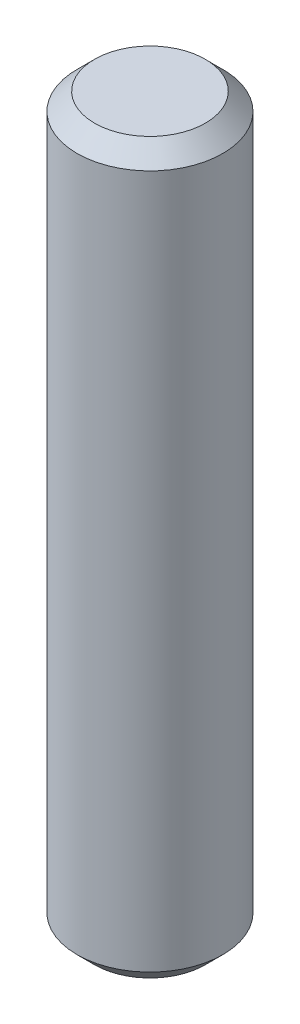
ISO-10303-21;
HEADER;
FILE_DESCRIPTION(('STEP AP214'),'2;1');
FILE_NAME('part.step','',(''),(''),'','','');
FILE_SCHEMA(('AUTOMOTIVE_DESIGN { 1 0 10303 214 1 1 1 1 }'));
ENDSEC;
DATA;
#1=APPLICATION_CONTEXT('core data for automotive mechanical design processes');
#2=APPLICATION_PROTOCOL_DEFINITION('international standard','automotive_design',2000,#1);
#3=PRODUCT_CONTEXT('',#1,'mechanical');
#4=PRODUCT('Part','Part','',(#3));
#5=PRODUCT_RELATED_PRODUCT_CATEGORY('part','',(#4));
#6=PRODUCT_DEFINITION_FORMATION('','',#4);
#7=PRODUCT_DEFINITION_CONTEXT('part definition',#1,'design');
#8=PRODUCT_DEFINITION('design','',#6,#7);
#9=PRODUCT_DEFINITION_SHAPE('','',#8);
#10=(LENGTH_UNIT() NAMED_UNIT(*) SI_UNIT(.MILLI.,.METRE.));
#11=(NAMED_UNIT(*) PLANE_ANGLE_UNIT() SI_UNIT($,.RADIAN.));
#12=(NAMED_UNIT(*) SI_UNIT($,.STERADIAN.) SOLID_ANGLE_UNIT());
#13=UNCERTAINTY_MEASURE_WITH_UNIT(LENGTH_MEASURE(1.E-05),#10,'distance_accuracy_value','');
#14=(GEOMETRIC_REPRESENTATION_CONTEXT(3) GLOBAL_UNCERTAINTY_ASSIGNED_CONTEXT((#13)) GLOBAL_UNIT_ASSIGNED_CONTEXT((#10,
#11,#12)) REPRESENTATION_CONTEXT('',''));
#15=CARTESIAN_POINT('',(0.,0.,0.));
#16=DIRECTION('',(0.,0.,1.));
#17=DIRECTION('',(1.,0.,0.));
#18=AXIS2_PLACEMENT_3D('',#15,#16,#17);
#19=CARTESIAN_POINT('',(0.,63.5,0.));
#20=DIRECTION('',(0.,-1.,0.));
#21=DIRECTION('',(0.,0.,-1.));
#22=AXIS2_PLACEMENT_3D('',#19,#20,#21);
#23=CYLINDRICAL_SURFACE('',#22,6.35);
#24=CARTESIAN_POINT('',(0.,1.524,0.));
#25=DIRECTION('',(0.,1.,0.));
#26=DIRECTION('',(0.,0.,1.));
#27=AXIS2_PLACEMENT_3D('',#24,#25,#26);
#28=CIRCLE('',#27,6.35);
#29=CARTESIAN_POINT('',(0.,1.524,6.35));
#30=VERTEX_POINT('',#29);
#31=EDGE_CURVE('E53',#30,#30,#28,.T.);
#32=ORIENTED_EDGE('',*,*,#31,.T.);
#33=EDGE_LOOP('',(#32));
#34=FACE_BOUND('',#33,.T.);
#35=CARTESIAN_POINT('',(0.,61.976,0.));
#36=DIRECTION('',(0.,1.,0.));
#37=DIRECTION('',(0.,0.,1.));
#38=AXIS2_PLACEMENT_3D('',#35,#36,#37);
#39=CIRCLE('',#38,6.35);
#40=CARTESIAN_POINT('',(0.,61.976,6.35));
#41=VERTEX_POINT('',#40);
#42=EDGE_CURVE('E58',#41,#41,#39,.F.);
#43=ORIENTED_EDGE('',*,*,#42,.T.);
#44=EDGE_LOOP('',(#43));
#45=FACE_BOUND('',#44,.T.);
#46=ADVANCED_FACE('F39',(#34,#45),#23,.T.);
#47=CARTESIAN_POINT('',(0.,63.5,0.));
#48=DIRECTION('',(0.,1.,0.));
#49=DIRECTION('',(0.,0.,1.));
#50=AXIS2_PLACEMENT_3D('',#47,#48,#49);
#51=PLANE('',#50);
#52=CARTESIAN_POINT('',(0.,63.5,0.));
#53=DIRECTION('',(0.,1.,0.));
#54=DIRECTION('',(0.,0.,1.));
#55=AXIS2_PLACEMENT_3D('',#52,#53,#54);
#56=CIRCLE('',#55,4.826);
#57=CARTESIAN_POINT('',(0.,63.5,4.826));
#58=VERTEX_POINT('',#57);
#59=EDGE_CURVE('E10',#58,#58,#56,.T.);
#60=ORIENTED_EDGE('',*,*,#59,.T.);
#61=EDGE_LOOP('',(#60));
#62=FACE_BOUND('',#61,.T.);
#63=ADVANCED_FACE('F75',(#62),#51,.T.);
#64=CARTESIAN_POINT('',(0.,0.,0.));
#65=DIRECTION('',(0.,1.,0.));
#66=DIRECTION('',(0.,0.,1.));
#67=AXIS2_PLACEMENT_3D('',#64,#65,#66);
#68=PLANE('',#67);
#69=CARTESIAN_POINT('',(0.,0.,0.));
#70=DIRECTION('',(0.,1.,0.));
#71=DIRECTION('',(0.,0.,1.));
#72=AXIS2_PLACEMENT_3D('',#69,#70,#71);
#73=CIRCLE('',#72,4.826);
#74=CARTESIAN_POINT('',(0.,0.,4.826));
#75=VERTEX_POINT('',#74);
#76=EDGE_CURVE('E48',#75,#75,#73,.F.);
#77=ORIENTED_EDGE('',*,*,#76,.T.);
#78=EDGE_LOOP('',(#77));
#79=FACE_BOUND('',#78,.T.);
#80=ADVANCED_FACE('F72',(#79),#68,.F.);
#81=CARTESIAN_POINT('',(0.,1.524,0.));
#82=DIRECTION('',(0.,1.,0.));
#83=DIRECTION('',(0.,0.,1.));
#84=AXIS2_PLACEMENT_3D('',#81,#82,#83);
#85=CONICAL_SURFACE('',#84,6.35,0.78539816339745);
#86=ORIENTED_EDGE('',*,*,#76,.F.);
#87=EDGE_LOOP('',(#86));
#88=FACE_BOUND('',#87,.T.);
#89=ORIENTED_EDGE('',*,*,#31,.F.);
#90=EDGE_LOOP('',(#89));
#91=FACE_BOUND('',#90,.T.);
#92=ADVANCED_FACE('F68',(#88,#91),#85,.T.);
#93=CARTESIAN_POINT('',(0.,63.5,0.));
#94=DIRECTION('',(0.,-1.,0.));
#95=DIRECTION('',(0.,0.,-1.));
#96=AXIS2_PLACEMENT_3D('',#93,#94,#95);
#97=CONICAL_SURFACE('',#96,4.826,0.78539816339745);
#98=ORIENTED_EDGE('',*,*,#42,.F.);
#99=EDGE_LOOP('',(#98));
#100=FACE_BOUND('',#99,.T.);
#101=ORIENTED_EDGE('',*,*,#59,.F.);
#102=EDGE_LOOP('',(#101));
#103=FACE_BOUND('',#102,.T.);
#104=ADVANCED_FACE('F42',(#100,#103),#97,.T.);
#105=CLOSED_SHELL('',(#46,#63,#80,#92,#104));
#106=MANIFOLD_SOLID_BREP('B2',#105);
#107=ADVANCED_BREP_SHAPE_REPRESENTATION('',(#18,#106),#14);
#108=SHAPE_DEFINITION_REPRESENTATION(#9,#107);
ENDSEC;
END-ISO-10303-21;
